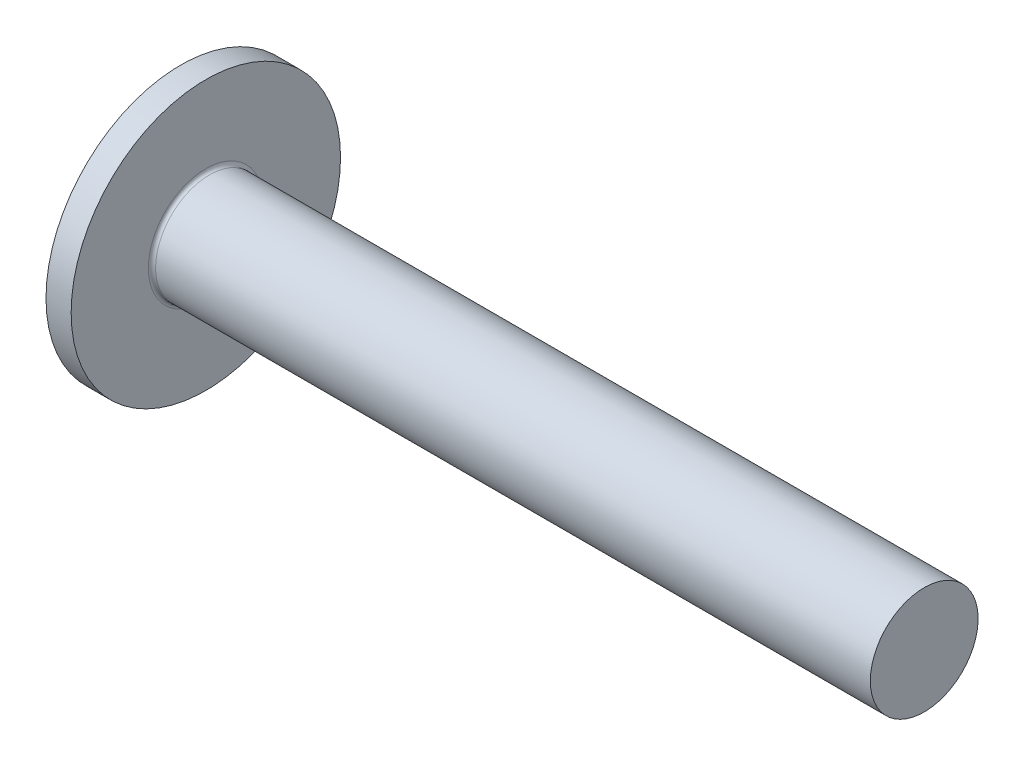
ISO-10303-21;
HEADER;
FILE_DESCRIPTION(('STEP AP214'),'2;1');
FILE_NAME('part.step','',(''),(''),'','','');
FILE_SCHEMA(('AUTOMOTIVE_DESIGN { 1 0 10303 214 1 1 1 1 }'));
ENDSEC;
DATA;
#1=APPLICATION_CONTEXT('core data for automotive mechanical design processes');
#2=APPLICATION_PROTOCOL_DEFINITION('international standard','automotive_design',2000,#1);
#3=PRODUCT_CONTEXT('',#1,'mechanical');
#4=PRODUCT('Part','Part','',(#3));
#5=PRODUCT_RELATED_PRODUCT_CATEGORY('part','',(#4));
#6=PRODUCT_DEFINITION_FORMATION('','',#4);
#7=PRODUCT_DEFINITION_CONTEXT('part definition',#1,'design');
#8=PRODUCT_DEFINITION('design','',#6,#7);
#9=PRODUCT_DEFINITION_SHAPE('','',#8);
#10=(LENGTH_UNIT() NAMED_UNIT(*) SI_UNIT(.MILLI.,.METRE.));
#11=(NAMED_UNIT(*) PLANE_ANGLE_UNIT() SI_UNIT($,.RADIAN.));
#12=(NAMED_UNIT(*) SI_UNIT($,.STERADIAN.) SOLID_ANGLE_UNIT());
#13=UNCERTAINTY_MEASURE_WITH_UNIT(LENGTH_MEASURE(1.E-05),#10,'distance_accuracy_value','');
#14=(GEOMETRIC_REPRESENTATION_CONTEXT(3) GLOBAL_UNCERTAINTY_ASSIGNED_CONTEXT((#13)) GLOBAL_UNIT_ASSIGNED_CONTEXT((#10,
#11,#12)) REPRESENTATION_CONTEXT('',''));
#15=CARTESIAN_POINT('',(0.,0.,0.));
#16=DIRECTION('',(0.,0.,1.));
#17=DIRECTION('',(1.,0.,0.));
#18=AXIS2_PLACEMENT_3D('',#15,#16,#17);
#19=CARTESIAN_POINT('',(1.83,-2.1065246820908,0.37));
#20=DIRECTION('',(0.,0.,1.));
#21=DIRECTION('',(1.,0.,0.));
#22=AXIS2_PLACEMENT_3D('',#19,#20,#21);
#23=PLANE('',#22);
#24=CARTESIAN_POINT('',(-1.32786673493863,-0.897219539779306,0.369999999999999));
#25=CARTESIAN_POINT('',(-1.06109337671372,-0.877038062199249,0.369999999999999));
#26=CARTESIAN_POINT('',(-0.794326989671652,-0.856763698073328,0.369999999999999));
#27=CARTESIAN_POINT('',(-0.260811337761784,-0.815970652270626,0.37));
#28=CARTESIAN_POINT('',(0.00593792699687842,-0.795451969167224,0.37));
#29=CARTESIAN_POINT('',(0.539412998487585,-0.754111978404016,0.37));
#30=CARTESIAN_POINT('',(0.806138805223047,-0.73329067078838,0.37));
#31=CARTESIAN_POINT('',(1.33955859559138,-0.691258233974201,0.37));
#32=CARTESIAN_POINT('',(1.60625257935677,-0.670047106460351,0.37));
#33=CARTESIAN_POINT('',(2.16947783557532,-0.624704906677519,0.37));
#34=CARTESIAN_POINT('',(2.4660042157795,-0.600512950110454,0.37));
#35=CARTESIAN_POINT('',(3.05898099108722,-0.551230034840946,0.37));
#36=CARTESIAN_POINT('',(3.3554313866421,-0.526139081609118,0.37));
#37=CARTESIAN_POINT('',(3.80002305717734,-0.487471420095905,0.37));
#38=CARTESIAN_POINT('',(3.94820908421183,-0.474410071891213,0.37));
#39=CARTESIAN_POINT('',(4.24454081076968,-0.447842423983589,0.37));
#40=CARTESIAN_POINT('',(4.39268651042475,-0.434336125751844,0.37));
#41=CARTESIAN_POINT('',(4.68892844322142,-0.406748557620139,0.370000000000001));
#42=CARTESIAN_POINT('',(4.83702467506998,-0.392667273720568,0.370000000000001));
#43=CARTESIAN_POINT('',(5.13313852244286,-0.3636862944742,0.370000000000001));
#44=CARTESIAN_POINT('',(5.28115613704881,-0.348786589770327,0.370000000000001));
#45=CARTESIAN_POINT('',(5.42911997966531,-0.33335595760015,0.370000000000001));
#46=B_SPLINE_CURVE_WITH_KNOTS('',3,(#24,#25,#26,#27,#28,#29,#30,#31,#32,#33,#34,#35,#36,#37,#38,
#39,#40,#41,#42,#43,#44,#45),.UNSPECIFIED.,.F.,.F.,(4,2,2,2,2,2,2,2,2,2,4),(0.,
0.802606976261602,1.60521864138463,2.40783018936098,3.21043826948614,4.10297224159255,
4.99550078333379,5.44178186811171,5.88806147744839,6.3343519591793,6.78064754445104),.UNSPECIFIED.);
#47=CARTESIAN_POINT('',(1.83000000000022,-0.65203220416821,0.37));
#48=VERTEX_POINT('',#47);
#49=CARTESIAN_POINT('',(0.101072692651104,-0.78805886515453,0.37));
#50=VERTEX_POINT('',#49);
#51=EDGE_CURVE('E326',#48,#50,#46,.F.);
#52=ORIENTED_EDGE('',*,*,#51,.F.);
#53=DIRECTION('',(0.,1.,0.));
#54=VECTOR('',#53,1.);
#55=CARTESIAN_POINT('',(1.83,-2.1065246820908,0.37));
#56=LINE('',#55,#54);
#57=CARTESIAN_POINT('',(1.83,-2.1065246820908,0.37));
#58=VERTEX_POINT('',#57);
#59=EDGE_CURVE('E285',#58,#48,#56,.T.);
#60=ORIENTED_EDGE('',*,*,#59,.F.);
#61=DIRECTION('',(0.941259815267089,-0.337683224580915,0.));
#62=VECTOR('',#61,1.);
#63=CARTESIAN_POINT('',(0.,-1.45,0.37));
#64=LINE('',#63,#62);
#65=CARTESIAN_POINT('',(0.364218312315864,-1.58066574410099,0.37));
#66=VERTEX_POINT('',#65);
#67=EDGE_CURVE('E271',#66,#58,#64,.T.);
#68=ORIENTED_EDGE('',*,*,#67,.F.);
#69=CARTESIAN_POINT('',(3.8,0.,0.37));
#70=DIRECTION('',(0.,0.,1.));
#71=DIRECTION('',(1.,0.,0.));
#72=AXIS2_PLACEMENT_3D('',#69,#70,#71);
#73=CIRCLE('',#72,3.78194394458723);
#74=EDGE_CURVE('E209',#50,#66,#73,.T.);
#75=ORIENTED_EDGE('',*,*,#74,.F.);
#76=EDGE_LOOP('',(#52,#60,#68,#75));
#77=FACE_BOUND('',#76,.T.);
#78=ADVANCED_FACE('F35',(#77),#23,.F.);
#79=CARTESIAN_POINT('',(1.83,2.1065246820908,-0.37));
#80=DIRECTION('',(0.,0.,-1.));
#81=DIRECTION('',(0.,1.,0.));
#82=AXIS2_PLACEMENT_3D('',#79,#80,#81);
#83=PLANE('',#82);
#84=CARTESIAN_POINT('',(-1.32786673493821,-0.897219539779274,-0.37));
#85=CARTESIAN_POINT('',(-1.06109337671331,-0.877038062199217,-0.37));
#86=CARTESIAN_POINT('',(-0.794326989671243,-0.856763698073297,-0.37));
#87=CARTESIAN_POINT('',(-0.260811337761386,-0.815970652270596,-0.37));
#88=CARTESIAN_POINT('',(0.00593792699727058,-0.795451969167194,-0.37));
#89=CARTESIAN_POINT('',(0.539412998487967,-0.754111978403986,-0.37));
#90=CARTESIAN_POINT('',(0.806138805223426,-0.733290670788351,-0.37));
#91=CARTESIAN_POINT('',(1.33955859559175,-0.691258233974171,-0.37));
#92=CARTESIAN_POINT('',(1.60625257935714,-0.670047106460322,-0.37));
#93=CARTESIAN_POINT('',(2.16947783557568,-0.624704906677489,-0.37));
#94=CARTESIAN_POINT('',(2.46600421577986,-0.600512950110424,-0.37));
#95=CARTESIAN_POINT('',(3.05898099108759,-0.551230034840916,-0.37));
#96=CARTESIAN_POINT('',(3.35543138664247,-0.526139081609087,-0.37));
#97=CARTESIAN_POINT('',(3.80002305717771,-0.487471420095873,-0.37));
#98=CARTESIAN_POINT('',(3.9482090842122,-0.474410071891181,-0.37));
#99=CARTESIAN_POINT('',(4.24454081077005,-0.447842423983555,-0.37));
#100=CARTESIAN_POINT('',(4.39268651042512,-0.43433612575181,-0.37));
#101=CARTESIAN_POINT('',(4.68892844322179,-0.406748557620104,-0.37));
#102=CARTESIAN_POINT('',(4.83702467507035,-0.392667273720533,-0.37));
#103=CARTESIAN_POINT('',(5.13313852244323,-0.363686294474164,-0.37));
#104=CARTESIAN_POINT('',(5.28115613704917,-0.34878658977029,-0.37));
#105=CARTESIAN_POINT('',(5.42911997966567,-0.333355957600112,-0.37));
#106=B_SPLINE_CURVE_WITH_KNOTS('',3,(#84,#85,#86,#87,#88,#89,#90,#91,#92,#93,#94,#95,#96,#97,
#98,#99,#100,#101,#102,#103,#104,#105),.UNSPECIFIED.,.F.,.F.,(4,2,2,2,2,2,2,2,2,2,4),(0.,
0.802606976261586,1.6052186413846,2.40783018936094,3.21043826948609,4.10297224159249,
4.99550078333373,5.44178186811167,5.88806147744834,6.33435195917925,6.78064754445099),.UNSPECIFIED.);
#107=CARTESIAN_POINT('',(0.101072692650653,-0.788058865154566,-0.37));
#108=VERTEX_POINT('',#107);
#109=CARTESIAN_POINT('',(1.83,-0.652032204167296,-0.37));
#110=VERTEX_POINT('',#109);
#111=EDGE_CURVE('E318',#108,#110,#106,.T.);
#112=ORIENTED_EDGE('',*,*,#111,.F.);
#113=CARTESIAN_POINT('',(3.8,0.,-0.37));
#114=DIRECTION('',(0.,0.,-1.));
#115=DIRECTION('',(0.,1.,0.));
#116=AXIS2_PLACEMENT_3D('',#113,#114,#115);
#117=CIRCLE('',#116,3.78194394458723);
#118=CARTESIAN_POINT('',(0.364218312315864,-1.58066574410099,-0.37));
#119=VERTEX_POINT('',#118);
#120=EDGE_CURVE('E214',#119,#108,#117,.T.);
#121=ORIENTED_EDGE('',*,*,#120,.F.);
#122=DIRECTION('',(0.941259815267089,-0.337683224580915,0.));
#123=VECTOR('',#122,1.);
#124=CARTESIAN_POINT('',(0.,-1.45,-0.37));
#125=LINE('',#124,#123);
#126=CARTESIAN_POINT('',(1.83,-2.1065246820908,-0.37));
#127=VERTEX_POINT('',#126);
#128=EDGE_CURVE('E274',#119,#127,#125,.T.);
#129=ORIENTED_EDGE('',*,*,#128,.T.);
#130=DIRECTION('',(0.,-1.,0.));
#131=VECTOR('',#130,1.);
#132=CARTESIAN_POINT('',(1.83,2.1065246820908,-0.37));
#133=LINE('',#132,#131);
#134=EDGE_CURVE('E284',#110,#127,#133,.T.);
#135=ORIENTED_EDGE('',*,*,#134,.F.);
#136=EDGE_LOOP('',(#112,#121,#129,#135));
#137=FACE_BOUND('',#136,.T.);
#138=ADVANCED_FACE('F167',(#137),#83,.F.);
#139=CARTESIAN_POINT('',(3.8,0.,0.));
#140=DIRECTION('',(-1.,0.,0.));
#141=DIRECTION('',(0.,1.,0.));
#142=AXIS2_PLACEMENT_3D('',#139,#140,#141);
#143=SPHERICAL_SURFACE('',#142,3.8);
#144=CARTESIAN_POINT('',(1.65,0.,0.));
#145=DIRECTION('',(1.,0.,0.));
#146=DIRECTION('',(0.,0.,-1.));
#147=AXIS2_PLACEMENT_3D('',#144,#145,#146);
#148=CIRCLE('',#147,3.13328900677866);
#149=CARTESIAN_POINT('',(1.65,0.,-3.13328900677866));
#150=VERTEX_POINT('',#149);
#151=EDGE_CURVE('E307',#150,#150,#148,.F.);
#152=ORIENTED_EDGE('',*,*,#151,.T.);
#153=EDGE_LOOP('',(#152));
#154=FACE_BOUND('',#153,.T.);
#155=CARTESIAN_POINT('',(0.101072692651104,0.,0.));
#156=DIRECTION('',(1.,0.,0.));
#157=DIRECTION('',(0.,0.,-1.));
#158=AXIS2_PLACEMENT_3D('',#155,#156,#157);
#159=CIRCLE('',#158,0.870595643768476);
#160=CARTESIAN_POINT('',(0.101072692651104,-0.369999999999997,-0.788058865154531));
#161=VERTEX_POINT('',#160);
#162=EDGE_CURVE('E312',#161,#108,#159,.F.);
#163=ORIENTED_EDGE('',*,*,#162,.F.);
#164=CARTESIAN_POINT('',(3.8,-0.37,0.));
#165=DIRECTION('',(0.,-1.,0.));
#166=DIRECTION('',(0.,0.,-1.));
#167=AXIS2_PLACEMENT_3D('',#164,#165,#166);
#168=CIRCLE('',#167,3.78194394458723);
#169=CARTESIAN_POINT('',(0.364218312315864,-0.369999999999994,-1.580665744101));
#170=VERTEX_POINT('',#169);
#171=EDGE_CURVE('E225',#161,#170,#168,.T.);
#172=ORIENTED_EDGE('',*,*,#171,.T.);
#173=CARTESIAN_POINT('',(2.90580705947687,0.,-2.49247762619686));
#174=DIRECTION('',(-0.337683224580915,0.,-0.94125981526709));
#175=DIRECTION('',(-0.94125981526709,0.,0.337683224580915));
#176=AXIS2_PLACEMENT_3D('',#173,#174,#175);
#177=CIRCLE('',#176,2.72543102426509);
#178=CARTESIAN_POINT('',(0.364218312315864,0.370000000000006,-1.58066574410099));
#179=VERTEX_POINT('',#178);
#180=EDGE_CURVE('E48',#170,#179,#177,.T.);
#181=ORIENTED_EDGE('',*,*,#180,.T.);
#182=CARTESIAN_POINT('',(3.8,0.37,0.));
#183=DIRECTION('',(0.,1.,0.));
#184=DIRECTION('',(0.,0.,1.));
#185=AXIS2_PLACEMENT_3D('',#182,#183,#184);
#186=CIRCLE('',#185,3.78194394458723);
#187=CARTESIAN_POINT('',(0.101072692651104,0.370000000000003,-0.788058865154528));
#188=VERTEX_POINT('',#187);
#189=EDGE_CURVE('E223',#179,#188,#186,.T.);
#190=ORIENTED_EDGE('',*,*,#189,.T.);
#191=CARTESIAN_POINT('',(0.101072692651104,0.788058865154531,-0.37));
#192=VERTEX_POINT('',#191);
#193=EDGE_CURVE('E333',#192,#188,#159,.F.);
#194=ORIENTED_EDGE('',*,*,#193,.F.);
#195=CARTESIAN_POINT('',(0.364218312315864,1.580665744101,-0.37));
#196=VERTEX_POINT('',#195);
#197=EDGE_CURVE('E309',#192,#196,#117,.T.);
#198=ORIENTED_EDGE('',*,*,#197,.T.);
#199=CARTESIAN_POINT('',(2.90580705947687,2.49247762619686,0.));
#200=DIRECTION('',(-0.337683224580915,0.941259815267089,0.));
#201=DIRECTION('',(-0.941259815267089,-0.337683224580915,0.));
#202=AXIS2_PLACEMENT_3D('',#199,#200,#201);
#203=CIRCLE('',#202,2.72543102426509);
#204=CARTESIAN_POINT('',(0.364218312315864,1.580665744101,0.37));
#205=VERTEX_POINT('',#204);
#206=EDGE_CURVE('E207',#196,#205,#203,.T.);
#207=ORIENTED_EDGE('',*,*,#206,.T.);
#208=CARTESIAN_POINT('',(0.101072692651104,0.78805886515453,0.37));
#209=VERTEX_POINT('',#208);
#210=EDGE_CURVE('E195',#205,#209,#73,.T.);
#211=ORIENTED_EDGE('',*,*,#210,.T.);
#212=CARTESIAN_POINT('',(0.101072692651105,0.369999999999997,0.788058865154532));
#213=VERTEX_POINT('',#212);
#214=EDGE_CURVE('E205',#213,#209,#159,.F.);
#215=ORIENTED_EDGE('',*,*,#214,.F.);
#216=CARTESIAN_POINT('',(0.364218312315864,0.369999999999994,1.580665744101));
#217=VERTEX_POINT('',#216);
#218=EDGE_CURVE('E242',#213,#217,#186,.T.);
#219=ORIENTED_EDGE('',*,*,#218,.T.);
#220=CARTESIAN_POINT('',(2.90580705947687,0.,2.49247762619686));
#221=DIRECTION('',(-0.337683224580915,0.,0.941259815267089));
#222=DIRECTION('',(0.941259815267089,0.,0.337683224580915));
#223=AXIS2_PLACEMENT_3D('',#220,#221,#222);
#224=CIRCLE('',#223,2.72543102426509);
#225=CARTESIAN_POINT('',(0.364218312315864,-0.370000000000005,1.58066574410099));
#226=VERTEX_POINT('',#225);
#227=EDGE_CURVE('E212',#217,#226,#224,.T.);
#228=ORIENTED_EDGE('',*,*,#227,.T.);
#229=CARTESIAN_POINT('',(0.101072692651104,-0.370000000000002,0.78805886515453));
#230=VERTEX_POINT('',#229);
#231=EDGE_CURVE('E270',#226,#230,#168,.T.);
#232=ORIENTED_EDGE('',*,*,#231,.T.);
#233=EDGE_CURVE('E199',#50,#230,#159,.F.);
#234=ORIENTED_EDGE('',*,*,#233,.F.);
#235=ORIENTED_EDGE('',*,*,#74,.T.);
#236=CARTESIAN_POINT('',(2.90580705947687,-2.49247762619686,0.));
#237=DIRECTION('',(-0.337683224580915,-0.94125981526709,0.));
#238=DIRECTION('',(0.94125981526709,-0.337683224580915,0.));
#239=AXIS2_PLACEMENT_3D('',#236,#237,#238);
#240=CIRCLE('',#239,2.72543102426509);
#241=EDGE_CURVE('E208',#66,#119,#240,.T.);
#242=ORIENTED_EDGE('',*,*,#241,.T.);
#243=ORIENTED_EDGE('',*,*,#120,.T.);
#244=EDGE_LOOP('',(#163,#172,#181,#190,#194,#198,#207,#211,#215,#219,#228,#232,#234,#235,#242,#243));
#245=FACE_BOUND('',#244,.T.);
#246=ADVANCED_FACE('F174',(#154,#245),#143,.T.);
#247=CARTESIAN_POINT('',(-1.32786673493863,0.897219539779306,0.369999999999999));
#248=CARTESIAN_POINT('',(-1.06109337671372,0.877038062199249,0.369999999999999));
#249=CARTESIAN_POINT('',(-0.794326989671651,0.856763698073328,0.369999999999999));
#250=CARTESIAN_POINT('',(-0.260811337761783,0.815970652270626,0.37));
#251=CARTESIAN_POINT('',(0.00593792699687869,0.795451969167224,0.37));
#252=CARTESIAN_POINT('',(0.539412998487584,0.754111978404016,0.37));
#253=CARTESIAN_POINT('',(0.806138805223046,0.733290670788381,0.37));
#254=CARTESIAN_POINT('',(1.33955859559138,0.691258233974201,0.37));
#255=CARTESIAN_POINT('',(1.60625257935677,0.670047106460351,0.37));
#256=CARTESIAN_POINT('',(2.16947783557532,0.624704906677519,0.37));
#257=CARTESIAN_POINT('',(2.4660042157795,0.600512950110454,0.37));
#258=CARTESIAN_POINT('',(3.05898099108723,0.551230034840946,0.37));
#259=CARTESIAN_POINT('',(3.3554313866421,0.526139081609118,0.37));
#260=CARTESIAN_POINT('',(3.80002305717734,0.487471420095905,0.37));
#261=CARTESIAN_POINT('',(3.94820908421183,0.474410071891213,0.37));
#262=CARTESIAN_POINT('',(4.24454081076968,0.447842423983588,0.37));
#263=CARTESIAN_POINT('',(4.39268651042475,0.434336125751843,0.37));
#264=CARTESIAN_POINT('',(4.68892844322142,0.406748557620139,0.370000000000001));
#265=CARTESIAN_POINT('',(4.83702467506998,0.392667273720567,0.370000000000001));
#266=CARTESIAN_POINT('',(5.13313852244287,0.3636862944742,0.370000000000001));
#267=CARTESIAN_POINT('',(5.28115613704881,0.348786589770327,0.370000000000001));
#268=CARTESIAN_POINT('',(5.42911997966531,0.33335595760015,0.370000000000001));
#269=B_SPLINE_CURVE_WITH_KNOTS('',3,(#247,#248,#249,#250,#251,#252,#253,#254,#255,#256,#257,
#258,#259,#260,#261,#262,#263,#264,#265,#266,#267,#268),.UNSPECIFIED.,.F.,.F.,(4,2,2,2,2,2,2,2,
2,2,4),(0.,0.802606976261603,1.60521864138463,2.40783018936098,3.21043826948614,
4.10297224159255,4.99550078333379,5.44178186811172,5.88806147744839,6.33435195917931,
6.78064754445104),.UNSPECIFIED.);
#270=CARTESIAN_POINT('',(1.83000000000022,0.65203220416821,0.37));
#271=VERTEX_POINT('',#270);
#272=EDGE_CURVE('E193',#209,#271,#269,.T.);
#273=ORIENTED_EDGE('',*,*,#272,.F.);
#274=ORIENTED_EDGE('',*,*,#210,.F.);
#275=DIRECTION('',(0.941259815267089,0.337683224580915,0.));
#276=VECTOR('',#275,1.);
#277=CARTESIAN_POINT('',(0.,1.45,0.37));
#278=LINE('',#277,#276);
#279=CARTESIAN_POINT('',(1.83,2.1065246820908,0.37));
#280=VERTEX_POINT('',#279);
#281=EDGE_CURVE('E62',#205,#280,#278,.T.);
#282=ORIENTED_EDGE('',*,*,#281,.T.);
#283=EDGE_CURVE('E197',#271,#280,#56,.T.);
#284=ORIENTED_EDGE('',*,*,#283,.F.);
#285=EDGE_LOOP('',(#273,#274,#282,#284));
#286=FACE_BOUND('',#285,.T.);
#287=ADVANCED_FACE('F170',(#286),#23,.F.);
#288=CARTESIAN_POINT('',(-1.32786673493863,0.897219539779306,-0.37));
#289=CARTESIAN_POINT('',(-1.06109337671372,0.877038062199249,-0.37));
#290=CARTESIAN_POINT('',(-0.794326989671651,0.856763698073328,-0.37));
#291=CARTESIAN_POINT('',(-0.260811337761784,0.815970652270626,-0.37));
#292=CARTESIAN_POINT('',(0.00593792699687848,0.795451969167224,-0.37));
#293=CARTESIAN_POINT('',(0.539412998487585,0.754111978404016,-0.37));
#294=CARTESIAN_POINT('',(0.806138805223047,0.73329067078838,-0.37));
#295=CARTESIAN_POINT('',(1.33955859559138,0.691258233974201,-0.37));
#296=CARTESIAN_POINT('',(1.60625257935677,0.670047106460351,-0.37));
#297=CARTESIAN_POINT('',(2.16947783557532,0.624704906677519,-0.37));
#298=CARTESIAN_POINT('',(2.4660042157795,0.600512950110454,-0.37));
#299=CARTESIAN_POINT('',(3.05898099108722,0.551230034840946,-0.37));
#300=CARTESIAN_POINT('',(3.3554313866421,0.526139081609118,-0.37));
#301=CARTESIAN_POINT('',(3.80002305717734,0.487471420095905,-0.37));
#302=CARTESIAN_POINT('',(3.94820908421183,0.474410071891214,-0.37));
#303=CARTESIAN_POINT('',(4.24454081076968,0.447842423983589,-0.37));
#304=CARTESIAN_POINT('',(4.39268651042475,0.434336125751844,-0.37));
#305=CARTESIAN_POINT('',(4.68892844322142,0.406748557620139,-0.37));
#306=CARTESIAN_POINT('',(4.83702467506998,0.392667273720568,-0.37));
#307=CARTESIAN_POINT('',(5.13313852244286,0.3636862944742,-0.37));
#308=CARTESIAN_POINT('',(5.28115613704881,0.348786589770328,-0.37));
#309=CARTESIAN_POINT('',(5.42911997966531,0.333355957600151,-0.37));
#310=B_SPLINE_CURVE_WITH_KNOTS('',3,(#288,#289,#290,#291,#292,#293,#294,#295,#296,#297,#298,
#299,#300,#301,#302,#303,#304,#305,#306,#307,#308,#309),.UNSPECIFIED.,.F.,.F.,(4,2,2,2,2,2,2,2,
2,2,4),(0.,0.802606976261602,1.60521864138463,2.40783018936098,3.21043826948614,
4.10297224159255,4.99550078333379,5.44178186811171,5.88806147744839,6.3343519591793,
6.78064754445104),.UNSPECIFIED.);
#311=CARTESIAN_POINT('',(1.83,0.652032204167296,-0.37));
#312=VERTEX_POINT('',#311);
#313=EDGE_CURVE('E342',#312,#192,#310,.F.);
#314=ORIENTED_EDGE('',*,*,#313,.F.);
#315=CARTESIAN_POINT('',(1.83,2.1065246820908,-0.37));
#316=VERTEX_POINT('',#315);
#317=EDGE_CURVE('E286',#316,#312,#133,.T.);
#318=ORIENTED_EDGE('',*,*,#317,.F.);
#319=DIRECTION('',(0.941259815267089,0.337683224580915,0.));
#320=VECTOR('',#319,1.);
#321=CARTESIAN_POINT('',(0.,1.45,-0.37));
#322=LINE('',#321,#320);
#323=EDGE_CURVE('E278',#196,#316,#322,.T.);
#324=ORIENTED_EDGE('',*,*,#323,.F.);
#325=ORIENTED_EDGE('',*,*,#197,.F.);
#326=EDGE_LOOP('',(#314,#318,#324,#325));
#327=FACE_BOUND('',#326,.T.);
#328=ADVANCED_FACE('F177',(#327),#83,.F.);
#329=CARTESIAN_POINT('',(1.83,2.1065246820908,0.37));
#330=DIRECTION('',(-1.,0.,0.));
#331=DIRECTION('',(0.,0.,1.));
#332=AXIS2_PLACEMENT_3D('',#329,#330,#331);
#333=PLANE('',#332);
#334=ORIENTED_EDGE('',*,*,#59,.T.);
#335=CARTESIAN_POINT('',(1.83,0.,0.));
#336=DIRECTION('',(-1.,0.,0.));
#337=DIRECTION('',(0.,0.,1.));
#338=AXIS2_PLACEMENT_3D('',#335,#336,#337);
#339=CIRCLE('',#338,0.749697269083503);
#340=EDGE_CURVE('E330',#48,#110,#339,.F.);
#341=ORIENTED_EDGE('',*,*,#340,.T.);
#342=ORIENTED_EDGE('',*,*,#134,.T.);
#343=DIRECTION('',(0.,0.,1.));
#344=VECTOR('',#343,1.);
#345=CARTESIAN_POINT('',(1.83,-2.1065246820908,-0.37));
#346=LINE('',#345,#344);
#347=EDGE_CURVE('E280',#127,#58,#346,.T.);
#348=ORIENTED_EDGE('',*,*,#347,.T.);
#349=EDGE_LOOP('',(#334,#341,#342,#348));
#350=FACE_BOUND('',#349,.T.);
#351=ADVANCED_FACE('F187',(#350),#333,.T.);
#352=DIRECTION('',(0.,0.,1.));
#353=VECTOR('',#352,1.);
#354=CARTESIAN_POINT('',(1.83,-0.369999999999993,-2.1065246820908));
#355=LINE('',#354,#353);
#356=CARTESIAN_POINT('',(1.83,-0.369999999999993,-2.1065246820908));
#357=VERTEX_POINT('',#356);
#358=CARTESIAN_POINT('',(1.83,-0.369999999999998,-0.652032204167297));
#359=VERTEX_POINT('',#358);
#360=EDGE_CURVE('E240',#357,#359,#355,.T.);
#361=ORIENTED_EDGE('',*,*,#360,.T.);
#362=CARTESIAN_POINT('',(1.83000000000022,0.370000000000003,-0.652032204168209));
#363=VERTEX_POINT('',#362);
#364=EDGE_CURVE('E366',#359,#363,#339,.F.);
#365=ORIENTED_EDGE('',*,*,#364,.T.);
#366=DIRECTION('',(0.,0.,-1.));
#367=VECTOR('',#366,1.);
#368=CARTESIAN_POINT('',(1.83,0.369999999999993,2.1065246820908));
#369=LINE('',#368,#367);
#370=CARTESIAN_POINT('',(1.83,0.370000000000008,-2.1065246820908));
#371=VERTEX_POINT('',#370);
#372=EDGE_CURVE('E262',#363,#371,#369,.T.);
#373=ORIENTED_EDGE('',*,*,#372,.T.);
#374=DIRECTION('',(0.,-1.,0.));
#375=VECTOR('',#374,1.);
#376=CARTESIAN_POINT('',(1.83,0.370000000000008,-2.1065246820908));
#377=LINE('',#376,#375);
#378=EDGE_CURVE('E258',#371,#357,#377,.T.);
#379=ORIENTED_EDGE('',*,*,#378,.T.);
#380=EDGE_LOOP('',(#361,#365,#373,#379));
#381=FACE_BOUND('',#380,.T.);
#382=ADVANCED_FACE('F447',(#381),#333,.T.);
#383=ORIENTED_EDGE('',*,*,#317,.T.);
#384=EDGE_CURVE('E328',#312,#271,#339,.F.);
#385=ORIENTED_EDGE('',*,*,#384,.T.);
#386=ORIENTED_EDGE('',*,*,#283,.T.);
#387=DIRECTION('',(0.,0.,-1.));
#388=VECTOR('',#387,1.);
#389=CARTESIAN_POINT('',(1.83,2.1065246820908,0.37));
#390=LINE('',#389,#388);
#391=EDGE_CURVE('E281',#280,#316,#390,.T.);
#392=ORIENTED_EDGE('',*,*,#391,.T.);
#393=EDGE_LOOP('',(#383,#385,#386,#392));
#394=FACE_BOUND('',#393,.T.);
#395=ADVANCED_FACE('F371',(#394),#333,.T.);
#396=CARTESIAN_POINT('',(1.83,0.369999999999993,2.1065246820908));
#397=DIRECTION('',(0.,1.,0.));
#398=DIRECTION('',(0.,0.,1.));
#399=AXIS2_PLACEMENT_3D('',#396,#397,#398);
#400=PLANE('',#399);
#401=CARTESIAN_POINT('',(-1.32786673493863,0.370000000000003,-0.897219539779304));
#402=CARTESIAN_POINT('',(-1.06109337671372,0.370000000000003,-0.877038062199247));
#403=CARTESIAN_POINT('',(-0.794326989671651,0.370000000000003,-0.856763698073327));
#404=CARTESIAN_POINT('',(-0.260811337761783,0.370000000000003,-0.815970652270625));
#405=CARTESIAN_POINT('',(0.00593792699687864,0.370000000000003,-0.795451969167223));
#406=CARTESIAN_POINT('',(0.539412998487585,0.370000000000003,-0.754111978404015));
#407=CARTESIAN_POINT('',(0.806138805223047,0.370000000000003,-0.733290670788379));
#408=CARTESIAN_POINT('',(1.33955859559138,0.370000000000003,-0.691258233974199));
#409=CARTESIAN_POINT('',(1.60625257935677,0.370000000000003,-0.67004710646035));
#410=CARTESIAN_POINT('',(2.16947783557532,0.370000000000002,-0.624704906677518));
#411=CARTESIAN_POINT('',(2.4660042157795,0.370000000000002,-0.600512950110453));
#412=CARTESIAN_POINT('',(3.05898099108723,0.370000000000002,-0.551230034840945));
#413=CARTESIAN_POINT('',(3.3554313866421,0.370000000000002,-0.526139081609117));
#414=CARTESIAN_POINT('',(3.80002305717734,0.370000000000002,-0.487471420095903));
#415=CARTESIAN_POINT('',(3.94820908421183,0.370000000000002,-0.474410071891212));
#416=CARTESIAN_POINT('',(4.24454081076968,0.370000000000002,-0.447842423983587));
#417=CARTESIAN_POINT('',(4.39268651042475,0.370000000000002,-0.434336125751842));
#418=CARTESIAN_POINT('',(4.68892844322142,0.370000000000002,-0.406748557620137));
#419=CARTESIAN_POINT('',(4.83702467506998,0.370000000000002,-0.392667273720566));
#420=CARTESIAN_POINT('',(5.13313852244286,0.370000000000002,-0.363686294474199));
#421=CARTESIAN_POINT('',(5.28115613704881,0.370000000000002,-0.348786589770326));
#422=CARTESIAN_POINT('',(5.42911997966531,0.370000000000002,-0.333355957600149));
#423=B_SPLINE_CURVE_WITH_KNOTS('',3,(#401,#402,#403,#404,#405,#406,#407,#408,#409,#410,#411,
#412,#413,#414,#415,#416,#417,#418,#419,#420,#421,#422),.UNSPECIFIED.,.F.,.F.,(4,2,2,2,2,2,2,2,
2,2,4),(0.,0.802606976261603,1.60521864138463,2.40783018936098,3.21043826948614,
4.10297224159255,4.99550078333379,5.44178186811172,5.88806147744839,6.3343519591793,
6.78064754445104),.UNSPECIFIED.);
#424=EDGE_CURVE('E362',#188,#363,#423,.T.);
#425=ORIENTED_EDGE('',*,*,#424,.F.);
#426=ORIENTED_EDGE('',*,*,#189,.F.);
#427=DIRECTION('',(0.941259815267089,0.,-0.337683224580915));
#428=VECTOR('',#427,1.);
#429=CARTESIAN_POINT('',(0.,0.370000000000005,-1.45));
#430=LINE('',#429,#428);
#431=EDGE_CURVE('E234',#179,#371,#430,.T.);
#432=ORIENTED_EDGE('',*,*,#431,.T.);
#433=ORIENTED_EDGE('',*,*,#372,.F.);
#434=EDGE_LOOP('',(#425,#426,#432,#433));
#435=FACE_BOUND('',#434,.T.);
#436=ADVANCED_FACE('F367',(#435),#400,.F.);
#437=CARTESIAN_POINT('',(1.83,-0.369999999999993,-2.1065246820908));
#438=DIRECTION('',(0.,-1.,0.));
#439=DIRECTION('',(1.,0.,0.));
#440=AXIS2_PLACEMENT_3D('',#437,#438,#439);
#441=PLANE('',#440);
#442=CARTESIAN_POINT('',(-1.32786673493863,-0.369999999999996,-0.897219539779307));
#443=CARTESIAN_POINT('',(-1.06109337671372,-0.369999999999996,-0.87703806219925));
#444=CARTESIAN_POINT('',(-0.794326989671652,-0.369999999999996,-0.856763698073329));
#445=CARTESIAN_POINT('',(-0.260811337761784,-0.369999999999997,-0.815970652270627));
#446=CARTESIAN_POINT('',(0.00593792699687848,-0.369999999999997,-0.795451969167226));
#447=CARTESIAN_POINT('',(0.539412998487585,-0.369999999999997,-0.754111978404017));
#448=CARTESIAN_POINT('',(0.806138805223046,-0.369999999999997,-0.733290670788382));
#449=CARTESIAN_POINT('',(1.33955859559138,-0.369999999999997,-0.691258233974202));
#450=CARTESIAN_POINT('',(1.60625257935677,-0.369999999999998,-0.670047106460352));
#451=CARTESIAN_POINT('',(2.16947783557532,-0.369999999999998,-0.62470490667752));
#452=CARTESIAN_POINT('',(2.4660042157795,-0.369999999999998,-0.600512950110455));
#453=CARTESIAN_POINT('',(3.05898099108723,-0.369999999999998,-0.551230034840948));
#454=CARTESIAN_POINT('',(3.3554313866421,-0.369999999999998,-0.526139081609119));
#455=CARTESIAN_POINT('',(3.80002305717734,-0.369999999999999,-0.487471420095906));
#456=CARTESIAN_POINT('',(3.94820908421183,-0.369999999999999,-0.474410071891215));
#457=CARTESIAN_POINT('',(4.24454081076968,-0.369999999999999,-0.44784242398359));
#458=CARTESIAN_POINT('',(4.39268651042475,-0.369999999999999,-0.434336125751845));
#459=CARTESIAN_POINT('',(4.68892844322142,-0.369999999999999,-0.40674855762014));
#460=CARTESIAN_POINT('',(4.83702467506998,-0.369999999999999,-0.392667273720569));
#461=CARTESIAN_POINT('',(5.13313852244286,-0.369999999999999,-0.363686294474202));
#462=CARTESIAN_POINT('',(5.28115613704881,-0.369999999999999,-0.348786589770329));
#463=CARTESIAN_POINT('',(5.42911997966531,-0.369999999999999,-0.333355957600152));
#464=B_SPLINE_CURVE_WITH_KNOTS('',3,(#442,#443,#444,#445,#446,#447,#448,#449,#450,#451,#452,
#453,#454,#455,#456,#457,#458,#459,#460,#461,#462,#463),.UNSPECIFIED.,.F.,.F.,(4,2,2,2,2,2,2,2,
2,2,4),(0.,0.802606976261603,1.60521864138463,2.40783018936098,3.21043826948614,
4.10297224159255,4.99550078333379,5.44178186811172,5.88806147744839,6.3343519591793,
6.78064754445104),.UNSPECIFIED.);
#465=EDGE_CURVE('E247',#359,#161,#464,.F.);
#466=ORIENTED_EDGE('',*,*,#465,.F.);
#467=ORIENTED_EDGE('',*,*,#360,.F.);
#468=DIRECTION('',(0.941259815267089,0.,-0.337683224580915));
#469=VECTOR('',#468,1.);
#470=CARTESIAN_POINT('',(0.,-0.369999999999995,-1.45));
#471=LINE('',#470,#469);
#472=EDGE_CURVE('E231',#170,#357,#471,.T.);
#473=ORIENTED_EDGE('',*,*,#472,.F.);
#474=ORIENTED_EDGE('',*,*,#171,.F.);
#475=EDGE_LOOP('',(#466,#467,#473,#474));
#476=FACE_BOUND('',#475,.T.);
#477=ADVANCED_FACE('F238',(#476),#441,.F.);
#478=CARTESIAN_POINT('',(-1.32786673493821,-0.370000000000003,0.897219539779273));
#479=CARTESIAN_POINT('',(-1.06109337671331,-0.370000000000003,0.877038062199216));
#480=CARTESIAN_POINT('',(-0.794326989671242,-0.370000000000003,0.856763698073296));
#481=CARTESIAN_POINT('',(-0.260811337761385,-0.370000000000002,0.815970652270594));
#482=CARTESIAN_POINT('',(0.0059379269972715,-0.370000000000002,0.795451969167193));
#483=CARTESIAN_POINT('',(0.539412998487968,-0.370000000000002,0.754111978403985));
#484=CARTESIAN_POINT('',(0.806138805223426,-0.370000000000002,0.73329067078835));
#485=CARTESIAN_POINT('',(1.33955859559175,-0.370000000000002,0.69125823397417));
#486=CARTESIAN_POINT('',(1.60625257935714,-0.370000000000002,0.67004710646032));
#487=CARTESIAN_POINT('',(2.16947783557568,-0.370000000000002,0.624704906677488));
#488=CARTESIAN_POINT('',(2.46600421577986,-0.370000000000002,0.600512950110423));
#489=CARTESIAN_POINT('',(3.05898099108759,-0.370000000000002,0.551230034840914));
#490=CARTESIAN_POINT('',(3.35543138664247,-0.370000000000002,0.526139081609086));
#491=CARTESIAN_POINT('',(3.8000230571777,-0.370000000000002,0.487471420095872));
#492=CARTESIAN_POINT('',(3.9482090842122,-0.370000000000002,0.47441007189118));
#493=CARTESIAN_POINT('',(4.24454081077005,-0.370000000000002,0.447842423983554));
#494=CARTESIAN_POINT('',(4.39268651042511,-0.370000000000002,0.434336125751809));
#495=CARTESIAN_POINT('',(4.68892844322179,-0.370000000000002,0.406748557620103));
#496=CARTESIAN_POINT('',(4.83702467507035,-0.370000000000002,0.392667273720531));
#497=CARTESIAN_POINT('',(5.13313852244323,-0.370000000000002,0.363686294474163));
#498=CARTESIAN_POINT('',(5.28115613704917,-0.370000000000002,0.348786589770289));
#499=CARTESIAN_POINT('',(5.42911997966567,-0.370000000000002,0.333355957600111));
#500=B_SPLINE_CURVE_WITH_KNOTS('',3,(#478,#479,#480,#481,#482,#483,#484,#485,#486,#487,#488,
#489,#490,#491,#492,#493,#494,#495,#496,#497,#498,#499),.UNSPECIFIED.,.F.,.F.,(4,2,2,2,2,2,2,2,
2,2,4),(0.,0.802606976261587,1.6052186413846,2.40783018936094,3.21043826948609,4.10297224159249,
4.99550078333373,5.44178186811166,5.88806147744834,6.33435195917925,6.78064754445098),.UNSPECIFIED.);
#501=CARTESIAN_POINT('',(1.83,-0.370000000000002,0.652032204167294));
#502=VERTEX_POINT('',#501);
#503=EDGE_CURVE('E200',#230,#502,#500,.T.);
#504=ORIENTED_EDGE('',*,*,#503,.F.);
#505=ORIENTED_EDGE('',*,*,#231,.F.);
#506=DIRECTION('',(0.941259815267089,0.,0.337683224580915));
#507=VECTOR('',#506,1.);
#508=CARTESIAN_POINT('',(0.,-0.370000000000005,1.45));
#509=LINE('',#508,#507);
#510=CARTESIAN_POINT('',(1.83,-0.370000000000007,2.1065246820908));
#511=VERTEX_POINT('',#510);
#512=EDGE_CURVE('E244',#226,#511,#509,.T.);
#513=ORIENTED_EDGE('',*,*,#512,.T.);
#514=EDGE_CURVE('E267',#502,#511,#355,.T.);
#515=ORIENTED_EDGE('',*,*,#514,.F.);
#516=EDGE_LOOP('',(#504,#505,#513,#515));
#517=FACE_BOUND('',#516,.T.);
#518=ADVANCED_FACE('F420',(#517),#441,.F.);
#519=CARTESIAN_POINT('',(-1.32786673493863,0.369999999999997,0.897219539779307));
#520=CARTESIAN_POINT('',(-1.06109337671372,0.369999999999997,0.87703806219925));
#521=CARTESIAN_POINT('',(-0.794326989671652,0.369999999999997,0.856763698073329));
#522=CARTESIAN_POINT('',(-0.260811337761784,0.369999999999997,0.815970652270627));
#523=CARTESIAN_POINT('',(0.00593792699687859,0.369999999999997,0.795451969167225));
#524=CARTESIAN_POINT('',(0.539412998487585,0.369999999999997,0.754111978404017));
#525=CARTESIAN_POINT('',(0.806138805223046,0.369999999999997,0.733290670788382));
#526=CARTESIAN_POINT('',(1.33955859559138,0.369999999999998,0.691258233974202));
#527=CARTESIAN_POINT('',(1.60625257935677,0.369999999999998,0.670047106460352));
#528=CARTESIAN_POINT('',(2.16947783557532,0.369999999999998,0.62470490667752));
#529=CARTESIAN_POINT('',(2.4660042157795,0.369999999999998,0.600512950110455));
#530=CARTESIAN_POINT('',(3.05898099108723,0.369999999999998,0.551230034840948));
#531=CARTESIAN_POINT('',(3.3554313866421,0.369999999999998,0.52613908160912));
#532=CARTESIAN_POINT('',(3.80002305717734,0.369999999999999,0.487471420095906));
#533=CARTESIAN_POINT('',(3.94820908421183,0.369999999999999,0.474410071891215));
#534=CARTESIAN_POINT('',(4.24454081076968,0.369999999999999,0.44784242398359));
#535=CARTESIAN_POINT('',(4.39268651042475,0.369999999999999,0.434336125751845));
#536=CARTESIAN_POINT('',(4.68892844322142,0.369999999999999,0.40674855762014));
#537=CARTESIAN_POINT('',(4.83702467506998,0.369999999999999,0.392667273720569));
#538=CARTESIAN_POINT('',(5.13313852244286,0.369999999999999,0.363686294474202));
#539=CARTESIAN_POINT('',(5.28115613704881,0.369999999999999,0.348786589770329));
#540=CARTESIAN_POINT('',(5.42911997966531,0.369999999999999,0.333355957600152));
#541=B_SPLINE_CURVE_WITH_KNOTS('',3,(#519,#520,#521,#522,#523,#524,#525,#526,#527,#528,#529,
#530,#531,#532,#533,#534,#535,#536,#537,#538,#539,#540),.UNSPECIFIED.,.F.,.F.,(4,2,2,2,2,2,2,2,
2,2,4),(0.,0.802606976261603,1.60521864138463,2.40783018936098,3.21043826948614,
4.10297224159255,4.99550078333379,5.44178186811172,5.88806147744839,6.3343519591793,
6.78064754445104),.UNSPECIFIED.);
#542=CARTESIAN_POINT('',(1.83,0.369999999999998,0.652032204167296));
#543=VERTEX_POINT('',#542);
#544=EDGE_CURVE('E11',#543,#213,#541,.F.);
#545=ORIENTED_EDGE('',*,*,#544,.F.);
#546=CARTESIAN_POINT('',(1.83,0.369999999999993,2.1065246820908));
#547=VERTEX_POINT('',#546);
#548=EDGE_CURVE('E263',#547,#543,#369,.T.);
#549=ORIENTED_EDGE('',*,*,#548,.F.);
#550=DIRECTION('',(0.941259815267089,0.,0.337683224580915));
#551=VECTOR('',#550,1.);
#552=CARTESIAN_POINT('',(0.,0.369999999999995,1.45));
#553=LINE('',#552,#551);
#554=EDGE_CURVE('E256',#217,#547,#553,.T.);
#555=ORIENTED_EDGE('',*,*,#554,.F.);
#556=ORIENTED_EDGE('',*,*,#218,.F.);
#557=EDGE_LOOP('',(#545,#549,#555,#556));
#558=FACE_BOUND('',#557,.T.);
#559=ADVANCED_FACE('F373',(#558),#400,.F.);
#560=CARTESIAN_POINT('',(-6.34999999999999,0.,0.));
#561=DIRECTION('',(-1.,0.,0.));
#562=DIRECTION('',(0.,0.,1.));
#563=AXIS2_PLACEMENT_3D('',#560,#561,#562);
#564=CYLINDRICAL_SURFACE('',#563,1.50000000000001);
#565=CARTESIAN_POINT('',(2.45,0.,0.));
#566=DIRECTION('',(-1.,0.,0.));
#567=DIRECTION('',(0.,0.,1.));
#568=AXIS2_PLACEMENT_3D('',#565,#566,#567);
#569=CIRCLE('',#568,1.50000000000001);
#570=CARTESIAN_POINT('',(2.45,0.,1.50000000000001));
#571=VERTEX_POINT('',#570);
#572=EDGE_CURVE('E304',#571,#571,#569,.F.);
#573=ORIENTED_EDGE('',*,*,#572,.T.);
#574=EDGE_LOOP('',(#573));
#575=FACE_BOUND('',#574,.T.);
#576=CARTESIAN_POINT('',(22.35,0.,0.));
#577=DIRECTION('',(-1.,0.,0.));
#578=DIRECTION('',(0.,0.,1.));
#579=AXIS2_PLACEMENT_3D('',#576,#577,#578);
#580=CIRCLE('',#579,1.50000000000001);
#581=CARTESIAN_POINT('',(22.35,0.,1.50000000000001));
#582=VERTEX_POINT('',#581);
#583=EDGE_CURVE('E298',#582,#582,#580,.T.);
#584=ORIENTED_EDGE('',*,*,#583,.T.);
#585=EDGE_LOOP('',(#584));
#586=FACE_BOUND('',#585,.T.);
#587=ADVANCED_FACE('F413',(#575,#586),#564,.T.);
#588=CARTESIAN_POINT('',(22.35,1.50000000000001,0.));
#589=DIRECTION('',(1.,0.,0.));
#590=DIRECTION('',(0.,0.,-1.));
#591=AXIS2_PLACEMENT_3D('',#588,#589,#590);
#592=PLANE('',#591);
#593=ORIENTED_EDGE('',*,*,#583,.F.);
#594=EDGE_LOOP('',(#593));
#595=FACE_BOUND('',#594,.T.);
#596=ADVANCED_FACE('F407',(#595),#592,.T.);
#597=CARTESIAN_POINT('',(1.65,3.75,0.));
#598=DIRECTION('',(1.,0.,0.));
#599=DIRECTION('',(0.,0.,-1.));
#600=AXIS2_PLACEMENT_3D('',#597,#598,#599);
#601=PLANE('',#600);
#602=ORIENTED_EDGE('',*,*,#151,.F.);
#603=EDGE_LOOP('',(#602));
#604=FACE_BOUND('',#603,.T.);
#605=CARTESIAN_POINT('',(1.65,0.,0.));
#606=DIRECTION('',(-1.,0.,0.));
#607=DIRECTION('',(0.,0.,1.));
#608=AXIS2_PLACEMENT_3D('',#605,#606,#607);
#609=CIRCLE('',#608,3.75);
#610=CARTESIAN_POINT('',(1.65,0.,3.75));
#611=VERTEX_POINT('',#610);
#612=EDGE_CURVE('E295',#611,#611,#609,.T.);
#613=ORIENTED_EDGE('',*,*,#612,.T.);
#614=EDGE_LOOP('',(#613));
#615=FACE_BOUND('',#614,.T.);
#616=ADVANCED_FACE('F401',(#604,#615),#601,.F.);
#617=CARTESIAN_POINT('',(-6.34999999999999,0.,0.));
#618=DIRECTION('',(-1.,0.,0.));
#619=DIRECTION('',(0.,0.,1.));
#620=AXIS2_PLACEMENT_3D('',#617,#618,#619);
#621=CYLINDRICAL_SURFACE('',#620,3.75);
#622=ORIENTED_EDGE('',*,*,#612,.F.);
#623=EDGE_LOOP('',(#622));
#624=FACE_BOUND('',#623,.T.);
#625=CARTESIAN_POINT('',(2.35,0.,0.));
#626=DIRECTION('',(-1.,0.,0.));
#627=DIRECTION('',(0.,0.,1.));
#628=AXIS2_PLACEMENT_3D('',#625,#626,#627);
#629=CIRCLE('',#628,3.75);
#630=CARTESIAN_POINT('',(2.35,0.,3.75));
#631=VERTEX_POINT('',#630);
#632=EDGE_CURVE('E273',#631,#631,#629,.T.);
#633=ORIENTED_EDGE('',*,*,#632,.T.);
#634=EDGE_LOOP('',(#633));
#635=FACE_BOUND('',#634,.T.);
#636=ADVANCED_FACE('F391',(#624,#635),#621,.T.);
#637=CARTESIAN_POINT('',(2.35,1.5,0.));
#638=DIRECTION('',(-1.,0.,0.));
#639=DIRECTION('',(0.,0.,1.));
#640=AXIS2_PLACEMENT_3D('',#637,#638,#639);
#641=PLANE('',#640);
#642=CARTESIAN_POINT('',(2.35,0.,0.));
#643=DIRECTION('',(-1.,0.,0.));
#644=DIRECTION('',(0.,0.,1.));
#645=AXIS2_PLACEMENT_3D('',#642,#643,#644);
#646=CIRCLE('',#645,1.60000000000001);
#647=CARTESIAN_POINT('',(2.35,0.,1.60000000000001));
#648=VERTEX_POINT('',#647);
#649=EDGE_CURVE('E301',#648,#648,#646,.T.);
#650=ORIENTED_EDGE('',*,*,#649,.T.);
#651=EDGE_LOOP('',(#650));
#652=FACE_BOUND('',#651,.T.);
#653=ORIENTED_EDGE('',*,*,#632,.F.);
#654=EDGE_LOOP('',(#653));
#655=FACE_BOUND('',#654,.T.);
#656=ADVANCED_FACE('F386',(#652,#655),#641,.F.);
#657=CARTESIAN_POINT('',(2.45,0.,0.));
#658=DIRECTION('',(-1.,0.,0.));
#659=DIRECTION('',(0.,0.,1.));
#660=AXIS2_PLACEMENT_3D('',#657,#658,#659);
#661=TOROIDAL_SURFACE('',#660,1.60000000000001,0.1);
#662=ORIENTED_EDGE('',*,*,#572,.F.);
#663=EDGE_LOOP('',(#662));
#664=FACE_BOUND('',#663,.T.);
#665=ORIENTED_EDGE('',*,*,#649,.F.);
#666=EDGE_LOOP('',(#665));
#667=FACE_BOUND('',#666,.T.);
#668=ADVANCED_FACE('F37',(#664,#667),#661,.F.);
#669=CARTESIAN_POINT('',(0.,-1.45,-0.37));
#670=DIRECTION('',(-0.337683224580915,-0.94125981526709,0.));
#671=DIRECTION('',(0.94125981526709,-0.337683224580915,0.));
#672=AXIS2_PLACEMENT_3D('',#669,#670,#671);
#673=PLANE('',#672);
#674=ORIENTED_EDGE('',*,*,#67,.T.);
#675=ORIENTED_EDGE('',*,*,#347,.F.);
#676=ORIENTED_EDGE('',*,*,#128,.F.);
#677=ORIENTED_EDGE('',*,*,#241,.F.);
#678=EDGE_LOOP('',(#674,#675,#676,#677));
#679=FACE_BOUND('',#678,.T.);
#680=ADVANCED_FACE('F320',(#679),#673,.F.);
#681=CARTESIAN_POINT('',(1.83,2.1065246820908,0.37));
#682=DIRECTION('',(-0.337683224580915,0.941259815267089,0.));
#683=DIRECTION('',(-0.941259815267089,-0.337683224580915,0.));
#684=AXIS2_PLACEMENT_3D('',#681,#682,#683);
#685=PLANE('',#684);
#686=ORIENTED_EDGE('',*,*,#323,.T.);
#687=ORIENTED_EDGE('',*,*,#391,.F.);
#688=ORIENTED_EDGE('',*,*,#281,.F.);
#689=ORIENTED_EDGE('',*,*,#206,.F.);
#690=EDGE_LOOP('',(#686,#687,#688,#689));
#691=FACE_BOUND('',#690,.T.);
#692=ADVANCED_FACE('F379',(#691),#685,.F.);
#693=ORIENTED_EDGE('',*,*,#548,.T.);
#694=EDGE_CURVE('E54',#543,#502,#339,.F.);
#695=ORIENTED_EDGE('',*,*,#694,.T.);
#696=ORIENTED_EDGE('',*,*,#514,.T.);
#697=DIRECTION('',(0.,1.,0.));
#698=VECTOR('',#697,1.);
#699=CARTESIAN_POINT('',(1.83,-0.370000000000007,2.1065246820908));
#700=LINE('',#699,#698);
#701=EDGE_CURVE('E259',#511,#547,#700,.T.);
#702=ORIENTED_EDGE('',*,*,#701,.T.);
#703=EDGE_LOOP('',(#693,#695,#696,#702));
#704=FACE_BOUND('',#703,.T.);
#705=ADVANCED_FACE('F384',(#704),#333,.T.);
#706=CARTESIAN_POINT('',(0.,0.370000000000005,-1.45));
#707=DIRECTION('',(-0.337683224580915,0.,-0.94125981526709));
#708=DIRECTION('',(0.94125981526709,0.,-0.337683224580915));
#709=AXIS2_PLACEMENT_3D('',#706,#707,#708);
#710=PLANE('',#709);
#711=ORIENTED_EDGE('',*,*,#472,.T.);
#712=ORIENTED_EDGE('',*,*,#378,.F.);
#713=ORIENTED_EDGE('',*,*,#431,.F.);
#714=ORIENTED_EDGE('',*,*,#180,.F.);
#715=EDGE_LOOP('',(#711,#712,#713,#714));
#716=FACE_BOUND('',#715,.T.);
#717=ADVANCED_FACE('F229',(#716),#710,.F.);
#718=CARTESIAN_POINT('',(1.83,-0.370000000000007,2.1065246820908));
#719=DIRECTION('',(-0.337683224580915,0.,0.941259815267089));
#720=DIRECTION('',(-0.941259815267089,0.,-0.337683224580915));
#721=AXIS2_PLACEMENT_3D('',#718,#719,#720);
#722=PLANE('',#721);
#723=ORIENTED_EDGE('',*,*,#554,.T.);
#724=ORIENTED_EDGE('',*,*,#701,.F.);
#725=ORIENTED_EDGE('',*,*,#512,.F.);
#726=ORIENTED_EDGE('',*,*,#227,.F.);
#727=EDGE_LOOP('',(#723,#724,#725,#726));
#728=FACE_BOUND('',#727,.T.);
#729=ADVANCED_FACE('F163',(#728),#722,.F.);
#730=CARTESIAN_POINT('',(4.6,0.,0.));
#731=DIRECTION('',(-1.,0.,0.));
#732=DIRECTION('',(0.,0.,1.));
#733=AXIS2_PLACEMENT_3D('',#730,#731,#732);
#734=CONICAL_SURFACE('',#733,0.555999999999999,0.0698131700797659);
#735=CARTESIAN_POINT('',(4.6,0.,0.));
#736=DIRECTION('',(-1.,0.,0.));
#737=DIRECTION('',(0.,0.,1.));
#738=AXIS2_PLACEMENT_3D('',#735,#736,#737);
#739=CIRCLE('',#738,0.555999999999999);
#740=CARTESIAN_POINT('',(4.6,0.,0.555999999999999));
#741=VERTEX_POINT('',#740);
#742=EDGE_CURVE('E445',#741,#741,#739,.T.);
#743=ORIENTED_EDGE('',*,*,#742,.F.);
#744=EDGE_LOOP('',(#743));
#745=FACE_BOUND('',#744,.T.);
#746=ORIENTED_EDGE('',*,*,#465,.T.);
#747=ORIENTED_EDGE('',*,*,#162,.T.);
#748=ORIENTED_EDGE('',*,*,#111,.T.);
#749=ORIENTED_EDGE('',*,*,#340,.F.);
#750=ORIENTED_EDGE('',*,*,#51,.T.);
#751=ORIENTED_EDGE('',*,*,#233,.T.);
#752=ORIENTED_EDGE('',*,*,#503,.T.);
#753=ORIENTED_EDGE('',*,*,#694,.F.);
#754=ORIENTED_EDGE('',*,*,#544,.T.);
#755=ORIENTED_EDGE('',*,*,#214,.T.);
#756=ORIENTED_EDGE('',*,*,#272,.T.);
#757=ORIENTED_EDGE('',*,*,#384,.F.);
#758=ORIENTED_EDGE('',*,*,#313,.T.);
#759=ORIENTED_EDGE('',*,*,#193,.T.);
#760=ORIENTED_EDGE('',*,*,#424,.T.);
#761=ORIENTED_EDGE('',*,*,#364,.F.);
#762=EDGE_LOOP('',(#746,#747,#748,#749,#750,#751,#752,#753,#754,#755,#756,#757,#758,#759,#760,#761));
#763=FACE_BOUND('',#762,.T.);
#764=ADVANCED_FACE('F157',(#745,#763),#734,.F.);
#765=CARTESIAN_POINT('',(4.78065535110549,0.,0.));
#766=DIRECTION('',(-1.,0.,0.));
#767=DIRECTION('',(0.,0.,1.));
#768=AXIS2_PLACEMENT_3D('',#765,#766,#767);
#769=CONICAL_SURFACE('',#768,0.,1.25663706143592);
#770=ORIENTED_EDGE('',*,*,#742,.T.);
#771=EDGE_LOOP('',(#770));
#772=FACE_BOUND('',#771,.T.);
#773=CARTESIAN_POINT('',(4.78065535110549,0.,0.));
#774=VERTEX_POINT('',#773);
#775=VERTEX_LOOP('',#774);
#776=FACE_BOUND('',#775,.T.);
#777=ADVANCED_FACE('F155',(#772,#776),#769,.F.);
#778=CLOSED_SHELL('',(#78,#138,#246,#287,#328,#351,#382,#395,#436,#477,#518,#559,#587,#596,#616,
#636,#656,#668,#680,#692,#705,#717,#729,#764,#777));
#779=MANIFOLD_SOLID_BREP('B2',#778);
#780=ADVANCED_BREP_SHAPE_REPRESENTATION('',(#18,#779),#14);
#781=SHAPE_DEFINITION_REPRESENTATION(#9,#780);
ENDSEC;
END-ISO-10303-21;
